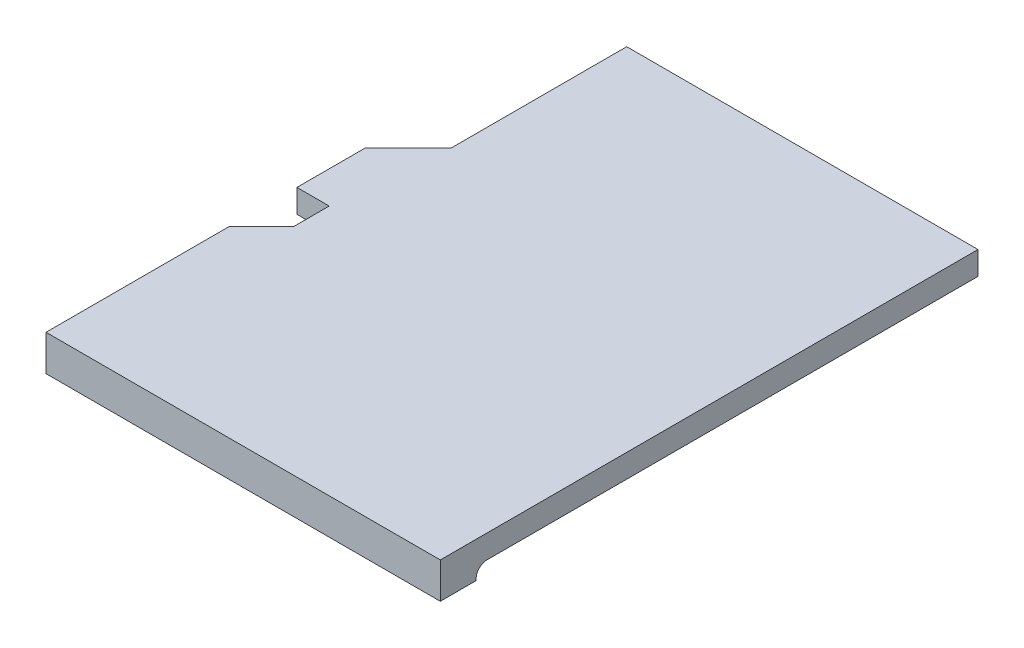
ISO-10303-21;
HEADER;
FILE_DESCRIPTION(('STEP AP214'),'2;1');
FILE_NAME('part.step','',(''),(''),'','','');
FILE_SCHEMA(('AUTOMOTIVE_DESIGN { 1 0 10303 214 1 1 1 1 }'));
ENDSEC;
DATA;
#1=APPLICATION_CONTEXT('core data for automotive mechanical design processes');
#2=APPLICATION_PROTOCOL_DEFINITION('international standard','automotive_design',2000,#1);
#3=PRODUCT_CONTEXT('',#1,'mechanical');
#4=PRODUCT('Part','Part','',(#3));
#5=PRODUCT_RELATED_PRODUCT_CATEGORY('part','',(#4));
#6=PRODUCT_DEFINITION_FORMATION('','',#4);
#7=PRODUCT_DEFINITION_CONTEXT('part definition',#1,'design');
#8=PRODUCT_DEFINITION('design','',#6,#7);
#9=PRODUCT_DEFINITION_SHAPE('','',#8);
#10=(LENGTH_UNIT() NAMED_UNIT(*) SI_UNIT(.MILLI.,.METRE.));
#11=(NAMED_UNIT(*) PLANE_ANGLE_UNIT() SI_UNIT($,.RADIAN.));
#12=(NAMED_UNIT(*) SI_UNIT($,.STERADIAN.) SOLID_ANGLE_UNIT());
#13=UNCERTAINTY_MEASURE_WITH_UNIT(LENGTH_MEASURE(1.E-05),#10,'distance_accuracy_value','');
#14=(GEOMETRIC_REPRESENTATION_CONTEXT(3) GLOBAL_UNCERTAINTY_ASSIGNED_CONTEXT((#13)) GLOBAL_UNIT_ASSIGNED_CONTEXT((#10,
#11,#12)) REPRESENTATION_CONTEXT('',''));
#15=CARTESIAN_POINT('',(0.,0.,0.));
#16=DIRECTION('',(0.,0.,1.));
#17=DIRECTION('',(1.,0.,0.));
#18=AXIS2_PLACEMENT_3D('',#15,#16,#17);
#19=CARTESIAN_POINT('',(0.,0.,36.5));
#20=DIRECTION('',(0.,-1.,0.));
#21=DIRECTION('',(0.,0.,-1.));
#22=AXIS2_PLACEMENT_3D('',#19,#20,#21);
#23=CYLINDRICAL_SURFACE('',#22,30.5);
#24=CARTESIAN_POINT('',(0.,-0.300000000000005,36.4999999999999));
#25=DIRECTION('',(0.,-1.,0.));
#26=DIRECTION('',(0.,0.,-1.));
#27=AXIS2_PLACEMENT_3D('',#24,#25,#26);
#28=CIRCLE('',#27,30.4999999999999);
#29=CARTESIAN_POINT('',(-5.5,-0.299999999999936,6.5000000000003));
#30=VERTEX_POINT('',#29);
#31=CARTESIAN_POINT('',(5.5,-0.3,6.5));
#32=VERTEX_POINT('',#31);
#33=EDGE_CURVE('E128',#30,#32,#28,.T.);
#34=ORIENTED_EDGE('',*,*,#33,.T.);
#35=DIRECTION('',(0.,-1.,0.));
#36=VECTOR('',#35,1.);
#37=CARTESIAN_POINT('',(5.5,0.,6.5));
#38=LINE('',#37,#36);
#39=CARTESIAN_POINT('',(5.5,-0.35,6.5));
#40=VERTEX_POINT('',#39);
#41=EDGE_CURVE('E114',#32,#40,#38,.T.);
#42=ORIENTED_EDGE('',*,*,#41,.T.);
#43=CARTESIAN_POINT('',(0.,-0.35,36.5));
#44=DIRECTION('',(0.,-1.,0.));
#45=DIRECTION('',(0.,0.,-1.));
#46=AXIS2_PLACEMENT_3D('',#43,#44,#45);
#47=CIRCLE('',#46,30.5);
#48=CARTESIAN_POINT('',(-5.5,-0.35,6.5));
#49=VERTEX_POINT('',#48);
#50=EDGE_CURVE('E142',#49,#40,#47,.T.);
#51=ORIENTED_EDGE('',*,*,#50,.F.);
#52=DIRECTION('',(0.,-1.,0.));
#53=VECTOR('',#52,1.);
#54=CARTESIAN_POINT('',(-5.5,0.,6.5));
#55=LINE('',#54,#53);
#56=EDGE_CURVE('E124',#49,#30,#55,.F.);
#57=ORIENTED_EDGE('',*,*,#56,.T.);
#58=EDGE_LOOP('',(#34,#42,#51,#57));
#59=FACE_BOUND('',#58,.T.);
#60=ADVANCED_FACE('F16',(#59),#23,.T.);
#61=CARTESIAN_POINT('',(0.,-0.300000000000007,36.4999999999999));
#62=DIRECTION('',(0.,1.,0.));
#63=DIRECTION('',(0.,0.,1.));
#64=AXIS2_PLACEMENT_3D('',#61,#62,#63);
#65=TOROIDAL_SURFACE('',#64,30.7999999999999,0.300000000000001);
#66=CARTESIAN_POINT('',(-5.5,0.,6.19504990929698));
#67=CARTESIAN_POINT('',(-5.5,1.33595165803878E-05,6.21241243593624));
#68=CARTESIAN_POINT('',(-5.5,-0.00145847501518897,6.22977221696308));
#69=CARTESIAN_POINT('',(-5.5,-0.00727537190632978,6.26399834794666));
#70=CARTESIAN_POINT('',(-5.5,-0.0116195368900843,6.28086485029587));
#71=CARTESIAN_POINT('',(-5.5,-0.0230876833958898,6.31363832371031));
#72=CARTESIAN_POINT('',(-5.5,-0.0302134268310064,6.32954467920917));
#73=CARTESIAN_POINT('',(-5.5,-0.0470507927273738,6.35991909095671));
#74=CARTESIAN_POINT('',(-5.5,-0.0567616224740036,6.37438758625935));
#75=CARTESIAN_POINT('',(-5.5,-0.0784276850797013,6.40135826971645));
#76=CARTESIAN_POINT('',(-5.5,-0.0903658227964889,6.41387418307365));
#77=CARTESIAN_POINT('',(-5.5,-0.116206697824979,6.43668838299136));
#78=CARTESIAN_POINT('',(-5.5,-0.130109746817412,6.4469863170733));
#79=CARTESIAN_POINT('',(-5.5,-0.159253139328433,6.4648982722723));
#80=CARTESIAN_POINT('',(-5.5,-0.17446970156573,6.47255103541422));
#81=CARTESIAN_POINT('',(-5.5,-0.205980553533483,6.48514460028019));
#82=CARTESIAN_POINT('',(-5.5,-0.22227394286474,6.4900876364088));
#83=CARTESIAN_POINT('',(-5.5,-0.248909602666306,6.49572631465982));
#84=CARTESIAN_POINT('',(-5.5,-0.259068672797319,6.4973280220839));
#85=CARTESIAN_POINT('',(-5.5,-0.279483577244796,6.49946458474798));
#86=CARTESIAN_POINT('',(-5.5,-0.289739251433868,6.50000097058269));
#87=CARTESIAN_POINT('',(-5.5,-0.299999999999871,6.50000000000061));
#88=B_SPLINE_CURVE_WITH_KNOTS('',3,(#66,#67,#68,#69,#70,#71,#72,#73,#74,#75,#76,#77,#78,#79,#80,
#81,#82,#83,#84,#85,#86,#87),.UNSPECIFIED.,.F.,.F.,(4,2,2,2,2,2,2,2,2,2,4),(0.,
0.0520216969549496,0.104027148927333,0.156065595891923,0.208088103654182,0.259726629690666,
0.311373356013652,0.362227951009608,0.413040548668621,0.443843163482689,0.474601490708804),.UNSPECIFIED.);
#89=CARTESIAN_POINT('',(-5.49999999999999,0.,6.19504990929698));
#90=VERTEX_POINT('',#89);
#91=EDGE_CURVE('E130',#90,#30,#88,.T.);
#92=ORIENTED_EDGE('',*,*,#91,.F.);
#93=CARTESIAN_POINT('',(-5.49999999999998,0.,6.19504990929698));
#94=CARTESIAN_POINT('',(-5.31863837402074,-2.79888751644408E-10,6.16213458757296));
#95=CARTESIAN_POINT('',(-5.13698177051986,-3.89986718033549E-11,6.13084467826896));
#96=CARTESIAN_POINT('',(-4.77314267713024,-2.63799173422511E-10,6.07152558301701));
#97=CARTESIAN_POINT('',(-4.59096020355433,-7.29468067132481E-10,6.04349629701301));
#98=CARTESIAN_POINT('',(-4.22612778424785,-4.11527474624292E-09,5.99070711898726));
#99=CARTESIAN_POINT('',(-4.04347785274138,-7.03533871261316E-09,5.96594712866323));
#100=CARTESIAN_POINT('',(-3.67776898719352,-1.7491268445544E-08,5.91970526678066));
#101=CARTESIAN_POINT('',(-3.49471006535823,-2.50269982460297E-08,5.898223298683));
#102=CARTESIAN_POINT('',(-3.12824231984767,-5.2489278225927E-08,5.85853971393701));
#103=CARTESIAN_POINT('',(-2.94483350641475,-7.24154710846567E-08,5.84033800271096));
#104=CARTESIAN_POINT('',(-2.57765331341793,-1.16842041325099E-07,5.80723049133915));
#105=CARTESIAN_POINT('',(-2.39388182880072,-1.41344029382589E-07,5.79232585580913));
#106=CARTESIAN_POINT('',(-2.02611648635591,-1.68785372301173E-07,5.7658417103048));
#107=CARTESIAN_POINT('',(-1.84212265072332,-1.71726725960301E-07,5.75426189219593));
#108=CARTESIAN_POINT('',(-1.47397325036579,-1.5812156273675E-07,5.73443005392329));
#109=CARTESIAN_POINT('',(-1.28981770257959,-1.41576888643872E-07,5.72617771917914));
#110=CARTESIAN_POINT('',(-0.92140570267484,-9.59041238819305E-08,5.71298847020463));
#111=CARTESIAN_POINT('',(-0.737149261997189,-6.67772466262512E-08,5.70805123638695));
#112=CARTESIAN_POINT('',(-0.368594128918169,-2.07680761947441E-08,5.70154964542096));
#113=CARTESIAN_POINT('',(-0.184295442448436,-3.88457999455793E-09,5.69998495685937));
#114=CARTESIAN_POINT('',(0.086356471172345,1.82022081381326E-09,5.70000704885872));
#115=CARTESIAN_POINT('',(0.172712230075287,7.86351842313828E-10,5.70036094948924));
#116=CARTESIAN_POINT('',(0.476263755755936,-2.79274083912713E-09,5.7028806791863));
#117=CARTESIAN_POINT('',(0.693448061531879,-5.25435587275127E-09,5.7069794575203));
#118=CARTESIAN_POINT('',(1.06816857762278,-1.97365099193209E-08,5.71801281588737));
#119=CARTESIAN_POINT('',(1.22573814440945,-2.8952196858608E-08,5.72386224765594));
#120=CARTESIAN_POINT('',(1.48630232058884,-4.72230161169837E-08,5.7355408202662));
#121=CARTESIAN_POINT('',(1.58932833528275,-5.52318131245086E-08,5.74067760392298));
#122=CARTESIAN_POINT('',(1.88171570179904,-7.7766223504317E-08,5.75673240973428));
#123=CARTESIAN_POINT('',(2.07101095849516,-9.21235436615534E-08,5.76888568094614));
#124=CARTESIAN_POINT('',(2.42722706640843,-1.10143179472391E-07,5.79507406154739));
#125=CARTESIAN_POINT('',(2.59417658530175,-1.14859561468694E-07,5.80872308812261));
#126=CARTESIAN_POINT('',(2.94460729886679,-1.15857233898678E-07,5.84026240269234));
#127=CARTESIAN_POINT('',(3.12806264619123,-1.11242583252215E-07,5.85844117104809));
#128=CARTESIAN_POINT('',(3.4946095666402,-9.80308122850376E-08,5.89809426472975));
#129=CARTESIAN_POINT('',(3.67770115300804,-8.94338397180247E-08,5.91956846776736));
#130=CARTESIAN_POINT('',(4.04346152617939,-6.89925498860165E-08,5.96580673193215));
#131=CARTESIAN_POINT('',(4.22613032868293,-5.71483552225677E-08,5.99057066883453));
#132=CARTESIAN_POINT('',(4.59098584954234,-3.40389433412459E-08,6.04337962935026));
#133=CARTESIAN_POINT('',(4.77317258614175,-2.27737039070489E-08,6.07142452692736));
#134=CARTESIAN_POINT('',(5.13700500332876,-5.88767180051038E-09,6.13078580710959));
#135=CARTESIAN_POINT('',(5.31865070476836,-2.66658712612276E-10,6.16210206191056));
#136=CARTESIAN_POINT('',(5.5,0.,6.19504990929699));
#137=B_SPLINE_CURVE_WITH_KNOTS('',3,(#93,#94,#95,#96,#97,#98,#99,#100,#101,#102,#103,#104,#105,
#106,#107,#108,#109,#110,#111,#112,#113,#114,#115,#116,#117,#118,#119,#120,#121,#122,#123,#124,
#125,#126,#127,#128,#129,#130,#131,#132,#133,#134,#135,#136),.UNSPECIFIED.,.F.,.F.,(4,2,2,2,2,2,
2,2,2,2,2,2,2,2,2,2,2,2,2,2,2,4),(0.,0.552965554943508,1.10591413701329,1.65884608905149,
2.21176175386818,2.7646614742412,3.31775618290503,3.87079961577708,4.42379075163999,
4.97672856956743,5.52961204892394,5.78868012794092,6.44029213807924,6.91330877259719,
7.22276653290295,7.79178519840863,8.29428388730775,8.84731463363147,9.40032486283035,
9.95331421554694,10.5062823324631,11.0592288542998),.UNSPECIFIED.);
#138=CARTESIAN_POINT('',(5.5,0.,6.19504990929699));
#139=VERTEX_POINT('',#138);
#140=EDGE_CURVE('E133',#90,#139,#137,.T.);
#141=ORIENTED_EDGE('',*,*,#140,.T.);
#142=CARTESIAN_POINT('',(5.5,-0.3,6.5));
#143=CARTESIAN_POINT('',(5.5,-0.283322033831807,6.50001549356666));
#144=CARTESIAN_POINT('',(5.5,-0.266650004276067,6.49858702142147));
#145=CARTESIAN_POINT('',(5.5,-0.233801135687459,6.49295846261932));
#146=CARTESIAN_POINT('',(5.5,-0.217623702847018,6.48876184803342));
#147=CARTESIAN_POINT('',(5.5,-0.186198268954705,6.4777110321617));
#148=CARTESIAN_POINT('',(5.5,-0.170950565515108,6.47085598500946));
#149=CARTESIAN_POINT('',(5.5,-0.141812064981635,6.45470279334797));
#150=CARTESIAN_POINT('',(5.5,-0.127921207933909,6.44540475685212));
#151=CARTESIAN_POINT('',(5.5,-0.101775526700828,6.42456502241336));
#152=CARTESIAN_POINT('',(5.5,-0.0895331842519982,6.41300767257655));
#153=CARTESIAN_POINT('',(5.5,-0.06712443406094,6.38802757676602));
#154=CARTESIAN_POINT('',(5.5,-0.0569584894333177,6.37460441576588));
#155=CARTESIAN_POINT('',(5.5,-0.0388245484437589,6.34605271107503));
#156=CARTESIAN_POINT('',(5.5,-0.0308934171157404,6.33090077738875));
#157=CARTESIAN_POINT('',(5.5,-0.0176486348483923,6.29949574280969));
#158=CARTESIAN_POINT('',(5.5,-0.0123340399463629,6.28324304144946));
#159=CARTESIAN_POINT('',(5.5,-0.00560463299053523,6.25494252675228));
#160=CARTESIAN_POINT('',(5.5,-0.00350419577869252,6.24305287027581));
#161=CARTESIAN_POINT('',(5.5,-0.000701922640581662,6.21912686600849));
#162=CARTESIAN_POINT('',(5.5,1.87848171905319E-06,6.20709074834657));
#163=CARTESIAN_POINT('',(5.5,0.,6.19504990929699));
#164=B_SPLINE_CURVE_WITH_KNOTS('',3,(#142,#143,#144,#145,#146,#147,#148,#149,#150,#151,#152,
#153,#154,#155,#156,#157,#158,#159,#160,#161,#162,#163),.UNSPECIFIED.,.F.,.F.,(4,2,2,2,2,2,2,2,
2,2,4),(0.,0.0499640141518205,0.0998654774886299,0.149782831636377,0.199697979128594,
0.249972031679147,0.300257285014354,0.351329048386957,0.402382373173785,0.438526062389354,
0.474618857930604),.UNSPECIFIED.);
#165=EDGE_CURVE('E21',#32,#139,#164,.T.);
#166=ORIENTED_EDGE('',*,*,#165,.F.);
#167=ORIENTED_EDGE('',*,*,#33,.F.);
#168=EDGE_LOOP('',(#92,#141,#166,#167));
#169=FACE_BOUND('',#168,.T.);
#170=ADVANCED_FACE('F18',(#169),#65,.F.);
#171=CARTESIAN_POINT('',(0.,-0.35,6.93372741582503));
#172=DIRECTION('',(0.,-1.,0.));
#173=DIRECTION('',(0.,0.,-1.));
#174=AXIS2_PLACEMENT_3D('',#171,#172,#173);
#175=PLANE('',#174);
#176=DIRECTION('',(0.,0.,1.));
#177=VECTOR('',#176,1.);
#178=CARTESIAN_POINT('',(-5.5,-0.35,2.4));
#179=LINE('',#178,#177);
#180=CARTESIAN_POINT('',(-5.5,-0.35,7.5));
#181=VERTEX_POINT('',#180);
#182=EDGE_CURVE('E252',#49,#181,#179,.T.);
#183=ORIENTED_EDGE('',*,*,#182,.F.);
#184=ORIENTED_EDGE('',*,*,#50,.T.);
#185=DIRECTION('',(0.,0.,-1.));
#186=VECTOR('',#185,1.);
#187=CARTESIAN_POINT('',(5.5,-0.35,6.93372741582503));
#188=LINE('',#187,#186);
#189=CARTESIAN_POINT('',(5.5,-0.35,7.5));
#190=VERTEX_POINT('',#189);
#191=EDGE_CURVE('E120',#40,#190,#188,.F.);
#192=ORIENTED_EDGE('',*,*,#191,.T.);
#193=DIRECTION('',(1.,0.,0.));
#194=VECTOR('',#193,1.);
#195=CARTESIAN_POINT('',(-5.5,-0.35,7.5));
#196=LINE('',#195,#194);
#197=EDGE_CURVE('E213',#181,#190,#196,.T.);
#198=ORIENTED_EDGE('',*,*,#197,.F.);
#199=EDGE_LOOP('',(#183,#184,#192,#198));
#200=FACE_BOUND('',#199,.T.);
#201=ADVANCED_FACE('F157',(#200),#175,.T.);
#202=CARTESIAN_POINT('',(0.0936244587815548,0.,0.17467868973583));
#203=DIRECTION('',(0.,1.,0.));
#204=DIRECTION('',(0.,0.,1.));
#205=AXIS2_PLACEMENT_3D('',#202,#203,#204);
#206=PLANE('',#205);
#207=DIRECTION('',(-0.707106781186547,0.,0.707106781186548));
#208=VECTOR('',#207,1.);
#209=CARTESIAN_POINT('',(-4.6,0.,1.5));
#210=LINE('',#209,#208);
#211=CARTESIAN_POINT('',(-4.6,0.,1.5));
#212=VERTEX_POINT('',#211);
#213=CARTESIAN_POINT('',(-5.5,0.,2.4));
#214=VERTEX_POINT('',#213);
#215=EDGE_CURVE('E277',#212,#214,#210,.T.);
#216=ORIENTED_EDGE('',*,*,#215,.F.);
#217=DIRECTION('',(0.,0.,1.));
#218=VECTOR('',#217,1.);
#219=CARTESIAN_POINT('',(-4.6,0.,0.17467868973583));
#220=LINE('',#219,#218);
#221=CARTESIAN_POINT('',(-4.6,0.,0.5));
#222=VERTEX_POINT('',#221);
#223=EDGE_CURVE('E281',#222,#212,#220,.T.);
#224=ORIENTED_EDGE('',*,*,#223,.F.);
#225=DIRECTION('',(1.,0.,0.));
#226=VECTOR('',#225,1.);
#227=CARTESIAN_POINT('',(0.0936244587815548,0.,0.5));
#228=LINE('',#227,#226);
#229=CARTESIAN_POINT('',(-5.5,0.,0.5));
#230=VERTEX_POINT('',#229);
#231=EDGE_CURVE('E291',#230,#222,#228,.T.);
#232=ORIENTED_EDGE('',*,*,#231,.F.);
#233=DIRECTION('',(0.,0.,1.));
#234=VECTOR('',#233,1.);
#235=CARTESIAN_POINT('',(-5.5,0.,-1.4));
#236=LINE('',#235,#234);
#237=CARTESIAN_POINT('',(-5.5,0.,-1.4));
#238=VERTEX_POINT('',#237);
#239=EDGE_CURVE('E235',#238,#230,#236,.T.);
#240=ORIENTED_EDGE('',*,*,#239,.F.);
#241=DIRECTION('',(-0.707106781186548,0.,0.707106781186547));
#242=VECTOR('',#241,1.);
#243=CARTESIAN_POINT('',(-4.3,0.,-2.6));
#244=LINE('',#243,#242);
#245=CARTESIAN_POINT('',(-4.3,0.,-2.6));
#246=VERTEX_POINT('',#245);
#247=EDGE_CURVE('E236',#246,#238,#244,.T.);
#248=ORIENTED_EDGE('',*,*,#247,.F.);
#249=DIRECTION('',(0.,0.,1.));
#250=VECTOR('',#249,1.);
#251=CARTESIAN_POINT('',(-4.3,0.,-7.5));
#252=LINE('',#251,#250);
#253=CARTESIAN_POINT('',(-4.3,0.,-7.5));
#254=VERTEX_POINT('',#253);
#255=EDGE_CURVE('E241',#254,#246,#252,.T.);
#256=ORIENTED_EDGE('',*,*,#255,.F.);
#257=DIRECTION('',(-1.,0.,0.));
#258=VECTOR('',#257,1.);
#259=CARTESIAN_POINT('',(5.5,0.,-7.5));
#260=LINE('',#259,#258);
#261=CARTESIAN_POINT('',(5.5,0.,-7.5));
#262=VERTEX_POINT('',#261);
#263=EDGE_CURVE('E246',#262,#254,#260,.T.);
#264=ORIENTED_EDGE('',*,*,#263,.F.);
#265=DIRECTION('',(0.,0.,-1.));
#266=VECTOR('',#265,1.);
#267=CARTESIAN_POINT('',(5.5,0.,7.5));
#268=LINE('',#267,#266);
#269=EDGE_CURVE('E215',#139,#262,#268,.T.);
#270=ORIENTED_EDGE('',*,*,#269,.F.);
#271=ORIENTED_EDGE('',*,*,#140,.F.);
#272=DIRECTION('',(0.,0.,1.));
#273=VECTOR('',#272,1.);
#274=CARTESIAN_POINT('',(-5.5,0.,2.4));
#275=LINE('',#274,#273);
#276=EDGE_CURVE('E250',#214,#90,#275,.T.);
#277=ORIENTED_EDGE('',*,*,#276,.F.);
#278=EDGE_LOOP('',(#216,#224,#232,#240,#248,#256,#264,#270,#271,#277));
#279=FACE_BOUND('',#278,.T.);
#280=ADVANCED_FACE('F153',(#279),#206,.F.);
#281=CARTESIAN_POINT('',(-4.6,0.,1.5));
#282=DIRECTION('',(-0.707106781186548,0.,-0.707106781186547));
#283=DIRECTION('',(-0.707106781186547,0.,0.707106781186548));
#284=AXIS2_PLACEMENT_3D('',#281,#282,#283);
#285=PLANE('',#284);
#286=ORIENTED_EDGE('',*,*,#215,.T.);
#287=DIRECTION('',(0.,1.,0.));
#288=VECTOR('',#287,1.);
#289=CARTESIAN_POINT('',(-5.5,0.,2.4));
#290=LINE('',#289,#288);
#291=CARTESIAN_POINT('',(-5.5,0.65,2.4));
#292=VERTEX_POINT('',#291);
#293=EDGE_CURVE('E253',#292,#214,#290,.F.);
#294=ORIENTED_EDGE('',*,*,#293,.F.);
#295=DIRECTION('',(-0.707106781186548,0.,0.707106781186548));
#296=VECTOR('',#295,1.);
#297=CARTESIAN_POINT('',(-4.6,0.65,1.5));
#298=LINE('',#297,#296);
#299=CARTESIAN_POINT('',(-4.6,0.65,1.5));
#300=VERTEX_POINT('',#299);
#301=EDGE_CURVE('E228',#300,#292,#298,.T.);
#302=ORIENTED_EDGE('',*,*,#301,.F.);
#303=DIRECTION('',(0.,1.,0.));
#304=VECTOR('',#303,1.);
#305=CARTESIAN_POINT('',(-4.6,0.,1.5));
#306=LINE('',#305,#304);
#307=EDGE_CURVE('E287',#212,#300,#306,.T.);
#308=ORIENTED_EDGE('',*,*,#307,.F.);
#309=EDGE_LOOP('',(#286,#294,#302,#308));
#310=FACE_BOUND('',#309,.T.);
#311=ADVANCED_FACE('F150',(#310),#285,.T.);
#312=CARTESIAN_POINT('',(-5.5,0.,2.4));
#313=DIRECTION('',(-1.,0.,0.));
#314=DIRECTION('',(0.,0.,1.));
#315=AXIS2_PLACEMENT_3D('',#312,#313,#314);
#316=PLANE('',#315);
#317=ORIENTED_EDGE('',*,*,#182,.T.);
#318=DIRECTION('',(0.,1.,0.));
#319=VECTOR('',#318,1.);
#320=CARTESIAN_POINT('',(-5.5,0.,7.5));
#321=LINE('',#320,#319);
#322=CARTESIAN_POINT('',(-5.5,0.65,7.5));
#323=VERTEX_POINT('',#322);
#324=EDGE_CURVE('E266',#323,#181,#321,.F.);
#325=ORIENTED_EDGE('',*,*,#324,.F.);
#326=DIRECTION('',(0.,0.,1.));
#327=VECTOR('',#326,1.);
#328=CARTESIAN_POINT('',(-5.5,0.65,0.17467868973583));
#329=LINE('',#328,#327);
#330=EDGE_CURVE('E226',#292,#323,#329,.T.);
#331=ORIENTED_EDGE('',*,*,#330,.F.);
#332=ORIENTED_EDGE('',*,*,#293,.T.);
#333=ORIENTED_EDGE('',*,*,#276,.T.);
#334=ORIENTED_EDGE('',*,*,#91,.T.);
#335=ORIENTED_EDGE('',*,*,#56,.F.);
#336=EDGE_LOOP('',(#317,#325,#331,#332,#333,#334,#335));
#337=FACE_BOUND('',#336,.T.);
#338=ADVANCED_FACE('F144',(#337),#316,.T.);
#339=CARTESIAN_POINT('',(-5.5,0.,7.5));
#340=DIRECTION('',(0.,0.,1.));
#341=DIRECTION('',(1.,0.,0.));
#342=AXIS2_PLACEMENT_3D('',#339,#340,#341);
#343=PLANE('',#342);
#344=DIRECTION('',(0.,1.,0.));
#345=VECTOR('',#344,1.);
#346=CARTESIAN_POINT('',(5.5,0.,7.5));
#347=LINE('',#346,#345);
#348=CARTESIAN_POINT('',(5.5,0.65,7.5));
#349=VERTEX_POINT('',#348);
#350=EDGE_CURVE('E206',#349,#190,#347,.F.);
#351=ORIENTED_EDGE('',*,*,#350,.F.);
#352=DIRECTION('',(1.,0.,0.));
#353=VECTOR('',#352,1.);
#354=CARTESIAN_POINT('',(0.0936244587815549,0.65,7.5));
#355=LINE('',#354,#353);
#356=EDGE_CURVE('E210',#323,#349,#355,.T.);
#357=ORIENTED_EDGE('',*,*,#356,.F.);
#358=ORIENTED_EDGE('',*,*,#324,.T.);
#359=ORIENTED_EDGE('',*,*,#197,.T.);
#360=EDGE_LOOP('',(#351,#357,#358,#359));
#361=FACE_BOUND('',#360,.T.);
#362=ADVANCED_FACE('F149',(#361),#343,.T.);
#363=CARTESIAN_POINT('',(5.5,0.,7.5));
#364=DIRECTION('',(1.,0.,0.));
#365=DIRECTION('',(0.,0.,-1.));
#366=AXIS2_PLACEMENT_3D('',#363,#364,#365);
#367=PLANE('',#366);
#368=ORIENTED_EDGE('',*,*,#350,.T.);
#369=ORIENTED_EDGE('',*,*,#191,.F.);
#370=ORIENTED_EDGE('',*,*,#41,.F.);
#371=ORIENTED_EDGE('',*,*,#165,.T.);
#372=ORIENTED_EDGE('',*,*,#269,.T.);
#373=DIRECTION('',(0.,1.,0.));
#374=VECTOR('',#373,1.);
#375=CARTESIAN_POINT('',(5.5,0.,-7.5));
#376=LINE('',#375,#374);
#377=CARTESIAN_POINT('',(5.5,0.65,-7.5));
#378=VERTEX_POINT('',#377);
#379=EDGE_CURVE('E214',#378,#262,#376,.F.);
#380=ORIENTED_EDGE('',*,*,#379,.F.);
#381=DIRECTION('',(0.,0.,1.));
#382=VECTOR('',#381,1.);
#383=CARTESIAN_POINT('',(5.5,0.65,0.17467868973583));
#384=LINE('',#383,#382);
#385=EDGE_CURVE('E218',#349,#378,#384,.F.);
#386=ORIENTED_EDGE('',*,*,#385,.F.);
#387=EDGE_LOOP('',(#368,#369,#370,#371,#372,#380,#386));
#388=FACE_BOUND('',#387,.T.);
#389=ADVANCED_FACE('F117',(#388),#367,.T.);
#390=CARTESIAN_POINT('',(5.5,0.,-7.5));
#391=DIRECTION('',(0.,0.,-1.));
#392=DIRECTION('',(-1.,0.,0.));
#393=AXIS2_PLACEMENT_3D('',#390,#391,#392);
#394=PLANE('',#393);
#395=ORIENTED_EDGE('',*,*,#263,.T.);
#396=DIRECTION('',(0.,1.,0.));
#397=VECTOR('',#396,1.);
#398=CARTESIAN_POINT('',(-4.3,0.,-7.5));
#399=LINE('',#398,#397);
#400=CARTESIAN_POINT('',(-4.3,0.65,-7.5));
#401=VERTEX_POINT('',#400);
#402=EDGE_CURVE('E243',#401,#254,#399,.F.);
#403=ORIENTED_EDGE('',*,*,#402,.F.);
#404=DIRECTION('',(1.,0.,0.));
#405=VECTOR('',#404,1.);
#406=CARTESIAN_POINT('',(0.0936244587815549,0.65,-7.5));
#407=LINE('',#406,#405);
#408=EDGE_CURVE('E222',#378,#401,#407,.F.);
#409=ORIENTED_EDGE('',*,*,#408,.F.);
#410=ORIENTED_EDGE('',*,*,#379,.T.);
#411=EDGE_LOOP('',(#395,#403,#409,#410));
#412=FACE_BOUND('',#411,.T.);
#413=ADVANCED_FACE('F192',(#412),#394,.T.);
#414=CARTESIAN_POINT('',(-4.3,0.,-7.5));
#415=DIRECTION('',(-1.,0.,0.));
#416=DIRECTION('',(0.,0.,1.));
#417=AXIS2_PLACEMENT_3D('',#414,#415,#416);
#418=PLANE('',#417);
#419=ORIENTED_EDGE('',*,*,#255,.T.);
#420=DIRECTION('',(0.,1.,0.));
#421=VECTOR('',#420,1.);
#422=CARTESIAN_POINT('',(-4.3,0.,-2.6));
#423=LINE('',#422,#421);
#424=CARTESIAN_POINT('',(-4.3,0.65,-2.6));
#425=VERTEX_POINT('',#424);
#426=EDGE_CURVE('E238',#425,#246,#423,.F.);
#427=ORIENTED_EDGE('',*,*,#426,.F.);
#428=DIRECTION('',(0.,0.,1.));
#429=VECTOR('',#428,1.);
#430=CARTESIAN_POINT('',(-4.3,0.65,0.17467868973583));
#431=LINE('',#430,#429);
#432=EDGE_CURVE('E331',#401,#425,#431,.T.);
#433=ORIENTED_EDGE('',*,*,#432,.F.);
#434=ORIENTED_EDGE('',*,*,#402,.T.);
#435=EDGE_LOOP('',(#419,#427,#433,#434));
#436=FACE_BOUND('',#435,.T.);
#437=ADVANCED_FACE('F188',(#436),#418,.T.);
#438=CARTESIAN_POINT('',(-4.3,0.,-2.6));
#439=DIRECTION('',(-0.707106781186547,0.,-0.707106781186548));
#440=DIRECTION('',(-0.707106781186548,0.,0.707106781186547));
#441=AXIS2_PLACEMENT_3D('',#438,#439,#440);
#442=PLANE('',#441);
#443=ORIENTED_EDGE('',*,*,#247,.T.);
#444=DIRECTION('',(0.,1.,0.));
#445=VECTOR('',#444,1.);
#446=CARTESIAN_POINT('',(-5.5,0.,-1.4));
#447=LINE('',#446,#445);
#448=CARTESIAN_POINT('',(-5.5,0.65,-1.4));
#449=VERTEX_POINT('',#448);
#450=EDGE_CURVE('E232',#449,#238,#447,.F.);
#451=ORIENTED_EDGE('',*,*,#450,.F.);
#452=DIRECTION('',(-0.707106781186547,0.,0.707106781186547));
#453=VECTOR('',#452,1.);
#454=CARTESIAN_POINT('',(-4.3,0.65,-2.6));
#455=LINE('',#454,#453);
#456=EDGE_CURVE('E332',#425,#449,#455,.T.);
#457=ORIENTED_EDGE('',*,*,#456,.F.);
#458=ORIENTED_EDGE('',*,*,#426,.T.);
#459=EDGE_LOOP('',(#443,#451,#457,#458));
#460=FACE_BOUND('',#459,.T.);
#461=ADVANCED_FACE('F184',(#460),#442,.T.);
#462=CARTESIAN_POINT('',(-5.5,0.,-1.4));
#463=DIRECTION('',(-1.,0.,0.));
#464=DIRECTION('',(0.,0.,1.));
#465=AXIS2_PLACEMENT_3D('',#462,#463,#464);
#466=PLANE('',#465);
#467=ORIENTED_EDGE('',*,*,#239,.T.);
#468=DIRECTION('',(0.,1.,0.));
#469=VECTOR('',#468,1.);
#470=CARTESIAN_POINT('',(-5.5,0.,0.5));
#471=LINE('',#470,#469);
#472=CARTESIAN_POINT('',(-5.5,0.65,0.5));
#473=VERTEX_POINT('',#472);
#474=EDGE_CURVE('E299',#473,#230,#471,.F.);
#475=ORIENTED_EDGE('',*,*,#474,.F.);
#476=DIRECTION('',(0.,0.,1.));
#477=VECTOR('',#476,1.);
#478=CARTESIAN_POINT('',(-5.5,0.65,0.17467868973583));
#479=LINE('',#478,#477);
#480=EDGE_CURVE('E337',#449,#473,#479,.T.);
#481=ORIENTED_EDGE('',*,*,#480,.F.);
#482=ORIENTED_EDGE('',*,*,#450,.T.);
#483=EDGE_LOOP('',(#467,#475,#481,#482));
#484=FACE_BOUND('',#483,.T.);
#485=ADVANCED_FACE('F181',(#484),#466,.T.);
#486=CARTESIAN_POINT('',(-5.5,0.,0.5));
#487=DIRECTION('',(0.,0.,1.));
#488=DIRECTION('',(1.,0.,0.));
#489=AXIS2_PLACEMENT_3D('',#486,#487,#488);
#490=PLANE('',#489);
#491=ORIENTED_EDGE('',*,*,#231,.T.);
#492=DIRECTION('',(0.,1.,0.));
#493=VECTOR('',#492,1.);
#494=CARTESIAN_POINT('',(-4.6,0.,0.5));
#495=LINE('',#494,#493);
#496=CARTESIAN_POINT('',(-4.6,0.65,0.5));
#497=VERTEX_POINT('',#496);
#498=EDGE_CURVE('E40',#497,#222,#495,.F.);
#499=ORIENTED_EDGE('',*,*,#498,.F.);
#500=DIRECTION('',(1.,0.,0.));
#501=VECTOR('',#500,1.);
#502=CARTESIAN_POINT('',(0.0936244587815549,0.65,0.5));
#503=LINE('',#502,#501);
#504=EDGE_CURVE('E31',#473,#497,#503,.T.);
#505=ORIENTED_EDGE('',*,*,#504,.F.);
#506=ORIENTED_EDGE('',*,*,#474,.T.);
#507=EDGE_LOOP('',(#491,#499,#505,#506));
#508=FACE_BOUND('',#507,.T.);
#509=ADVANCED_FACE('F174',(#508),#490,.T.);
#510=CARTESIAN_POINT('',(-4.6,0.,0.5));
#511=DIRECTION('',(-1.,0.,0.));
#512=DIRECTION('',(0.,0.,1.));
#513=AXIS2_PLACEMENT_3D('',#510,#511,#512);
#514=PLANE('',#513);
#515=ORIENTED_EDGE('',*,*,#223,.T.);
#516=ORIENTED_EDGE('',*,*,#307,.T.);
#517=DIRECTION('',(0.,0.,1.));
#518=VECTOR('',#517,1.);
#519=CARTESIAN_POINT('',(-4.6,0.65,0.17467868973583));
#520=LINE('',#519,#518);
#521=EDGE_CURVE('E11',#497,#300,#520,.T.);
#522=ORIENTED_EDGE('',*,*,#521,.F.);
#523=ORIENTED_EDGE('',*,*,#498,.T.);
#524=EDGE_LOOP('',(#515,#516,#522,#523));
#525=FACE_BOUND('',#524,.T.);
#526=ADVANCED_FACE('F168',(#525),#514,.T.);
#527=CARTESIAN_POINT('',(0.0936244587815549,0.65,0.17467868973583));
#528=DIRECTION('',(0.,1.,0.));
#529=DIRECTION('',(0.,0.,1.));
#530=AXIS2_PLACEMENT_3D('',#527,#528,#529);
#531=PLANE('',#530);
#532=ORIENTED_EDGE('',*,*,#504,.T.);
#533=ORIENTED_EDGE('',*,*,#521,.T.);
#534=ORIENTED_EDGE('',*,*,#301,.T.);
#535=ORIENTED_EDGE('',*,*,#330,.T.);
#536=ORIENTED_EDGE('',*,*,#356,.T.);
#537=ORIENTED_EDGE('',*,*,#385,.T.);
#538=ORIENTED_EDGE('',*,*,#408,.T.);
#539=ORIENTED_EDGE('',*,*,#432,.T.);
#540=ORIENTED_EDGE('',*,*,#456,.T.);
#541=ORIENTED_EDGE('',*,*,#480,.T.);
#542=EDGE_LOOP('',(#532,#533,#534,#535,#536,#537,#538,#539,#540,#541));
#543=FACE_BOUND('',#542,.T.);
#544=ADVANCED_FACE('F166',(#543),#531,.T.);
#545=CLOSED_SHELL('',(#60,#170,#201,#280,#311,#338,#362,#389,#413,#437,#461,#485,#509,#526,#544));
#546=MANIFOLD_SOLID_BREP('B1',#545);
#547=ADVANCED_BREP_SHAPE_REPRESENTATION('',(#18,#546),#14);
#548=SHAPE_DEFINITION_REPRESENTATION(#9,#547);
ENDSEC;
END-ISO-10303-21;
